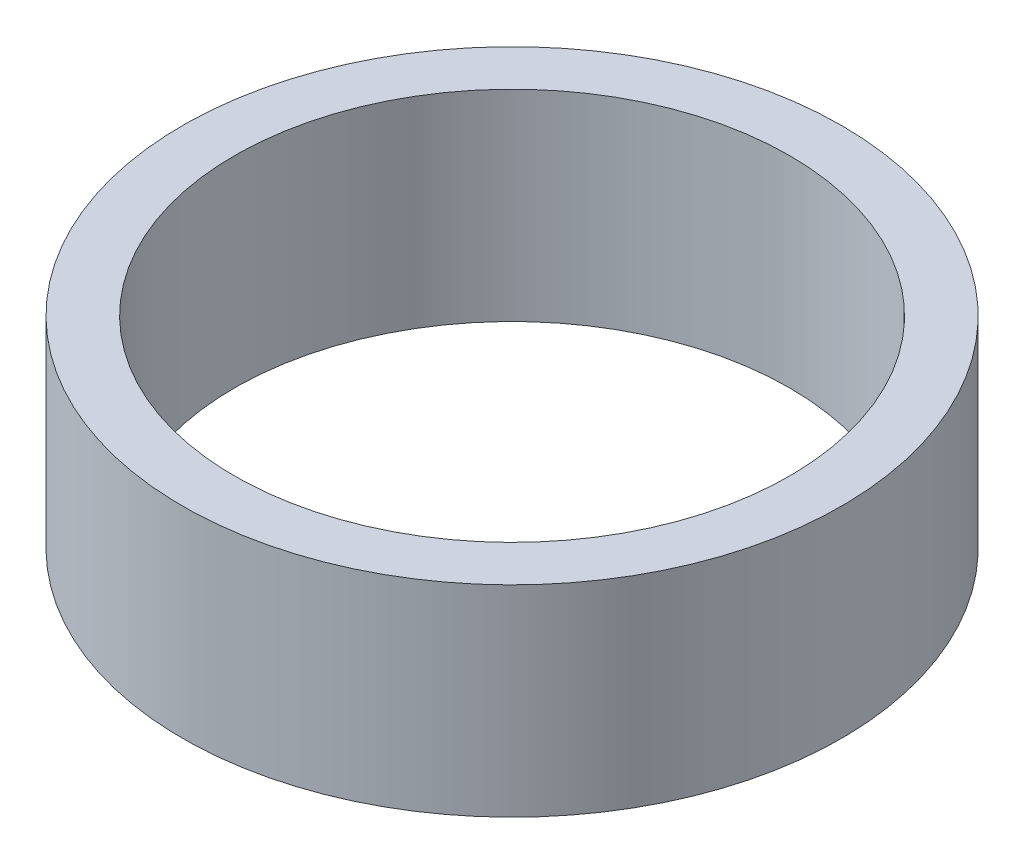
ISO-10303-21;
HEADER;
FILE_DESCRIPTION(('STEP AP214'),'2;1');
FILE_NAME('part.step','',(''),(''),'','','');
FILE_SCHEMA(('AUTOMOTIVE_DESIGN { 1 0 10303 214 1 1 1 1 }'));
ENDSEC;
DATA;
#1=APPLICATION_CONTEXT('core data for automotive mechanical design processes');
#2=APPLICATION_PROTOCOL_DEFINITION('international standard','automotive_design',2000,#1);
#3=PRODUCT_CONTEXT('',#1,'mechanical');
#4=PRODUCT('Part','Part','',(#3));
#5=PRODUCT_RELATED_PRODUCT_CATEGORY('part','',(#4));
#6=PRODUCT_DEFINITION_FORMATION('','',#4);
#7=PRODUCT_DEFINITION_CONTEXT('part definition',#1,'design');
#8=PRODUCT_DEFINITION('design','',#6,#7);
#9=PRODUCT_DEFINITION_SHAPE('','',#8);
#10=(LENGTH_UNIT() NAMED_UNIT(*) SI_UNIT(.MILLI.,.METRE.));
#11=(NAMED_UNIT(*) PLANE_ANGLE_UNIT() SI_UNIT($,.RADIAN.));
#12=(NAMED_UNIT(*) SI_UNIT($,.STERADIAN.) SOLID_ANGLE_UNIT());
#13=UNCERTAINTY_MEASURE_WITH_UNIT(LENGTH_MEASURE(1.E-05),#10,'distance_accuracy_value','');
#14=(GEOMETRIC_REPRESENTATION_CONTEXT(3) GLOBAL_UNCERTAINTY_ASSIGNED_CONTEXT((#13)) GLOBAL_UNIT_ASSIGNED_CONTEXT((#10,
#11,#12)) REPRESENTATION_CONTEXT('',''));
#15=CARTESIAN_POINT('',(0.,0.,0.));
#16=DIRECTION('',(0.,0.,1.));
#17=DIRECTION('',(1.,0.,0.));
#18=AXIS2_PLACEMENT_3D('',#15,#16,#17);
#19=CARTESIAN_POINT('',(0.,29.,0.));
#20=DIRECTION('',(0.,-1.,0.));
#21=DIRECTION('',(0.,0.,-1.));
#22=AXIS2_PLACEMENT_3D('',#19,#20,#21);
#23=CYLINDRICAL_SURFACE('',#22,47.5);
#24=CARTESIAN_POINT('',(0.,29.,0.));
#25=DIRECTION('',(0.,1.,0.));
#26=DIRECTION('',(0.,0.,1.));
#27=AXIS2_PLACEMENT_3D('',#24,#25,#26);
#28=CIRCLE('',#27,47.5);
#29=CARTESIAN_POINT('',(0.,29.,-47.5));
#30=VERTEX_POINT('',#29);
#31=EDGE_CURVE('E10',#30,#30,#28,.T.);
#32=CARTESIAN_POINT('',(0.,0.,0.));
#33=DIRECTION('',(0.,1.,0.));
#34=DIRECTION('',(0.,0.,1.));
#35=AXIS2_PLACEMENT_3D('',#32,#33,#34);
#36=CIRCLE('',#35,47.5);
#37=CARTESIAN_POINT('',(0.,0.,-47.5));
#38=VERTEX_POINT('',#37);
#39=EDGE_CURVE('E37',#38,#38,#36,.T.);
#40=CARTESIAN_POINT('',(0.,29.,-47.5));
#41=CARTESIAN_POINT('',(0.,28.6979166666667,-47.5));
#42=CARTESIAN_POINT('',(0.,28.3958333333333,-47.5));
#43=CARTESIAN_POINT('',(0.,27.7916666666667,-47.5));
#44=CARTESIAN_POINT('',(0.,27.4895833333333,-47.5));
#45=CARTESIAN_POINT('',(0.,26.8854166666667,-47.5));
#46=CARTESIAN_POINT('',(0.,26.5833333333333,-47.5));
#47=CARTESIAN_POINT('',(0.,25.9791666666667,-47.5));
#48=CARTESIAN_POINT('',(0.,25.6770833333333,-47.5));
#49=CARTESIAN_POINT('',(0.,25.0729166666667,-47.5));
#50=CARTESIAN_POINT('',(0.,24.7708333333333,-47.5));
#51=CARTESIAN_POINT('',(0.,24.1666666666667,-47.5));
#52=CARTESIAN_POINT('',(0.,23.8645833333333,-47.5));
#53=CARTESIAN_POINT('',(0.,23.2604166666667,-47.5));
#54=CARTESIAN_POINT('',(0.,22.9583333333333,-47.5));
#55=CARTESIAN_POINT('',(0.,22.3541666666667,-47.5));
#56=CARTESIAN_POINT('',(0.,22.0520833333333,-47.5));
#57=CARTESIAN_POINT('',(0.,21.4479166666667,-47.5));
#58=CARTESIAN_POINT('',(0.,21.1458333333333,-47.5));
#59=CARTESIAN_POINT('',(0.,20.5416666666667,-47.5));
#60=CARTESIAN_POINT('',(0.,20.2395833333333,-47.5));
#61=CARTESIAN_POINT('',(0.,19.6354166666667,-47.5));
#62=CARTESIAN_POINT('',(0.,19.3333333333333,-47.5));
#63=CARTESIAN_POINT('',(0.,18.7291666666667,-47.5));
#64=CARTESIAN_POINT('',(0.,18.4270833333333,-47.5));
#65=CARTESIAN_POINT('',(0.,17.8229166666667,-47.5));
#66=CARTESIAN_POINT('',(0.,17.5208333333333,-47.5));
#67=CARTESIAN_POINT('',(0.,16.9166666666667,-47.5));
#68=CARTESIAN_POINT('',(0.,16.6145833333333,-47.5));
#69=CARTESIAN_POINT('',(0.,16.0104166666667,-47.5));
#70=CARTESIAN_POINT('',(0.,15.7083333333333,-47.5));
#71=CARTESIAN_POINT('',(0.,15.1041666666667,-47.5));
#72=CARTESIAN_POINT('',(0.,14.8020833333333,-47.5));
#73=CARTESIAN_POINT('',(0.,14.1979166666667,-47.5));
#74=CARTESIAN_POINT('',(0.,13.8958333333333,-47.5));
#75=CARTESIAN_POINT('',(0.,13.2916666666667,-47.5));
#76=CARTESIAN_POINT('',(0.,12.9895833333333,-47.5));
#77=CARTESIAN_POINT('',(0.,12.3854166666667,-47.5));
#78=CARTESIAN_POINT('',(0.,12.0833333333333,-47.5));
#79=CARTESIAN_POINT('',(0.,11.4791666666667,-47.5));
#80=CARTESIAN_POINT('',(0.,11.1770833333333,-47.5));
#81=CARTESIAN_POINT('',(0.,10.5729166666667,-47.5));
#82=CARTESIAN_POINT('',(0.,10.2708333333333,-47.5));
#83=CARTESIAN_POINT('',(0.,9.66666666666667,-47.5));
#84=CARTESIAN_POINT('',(0.,9.36458333333333,-47.5));
#85=CARTESIAN_POINT('',(0.,8.76041666666667,-47.5));
#86=CARTESIAN_POINT('',(0.,8.45833333333333,-47.5));
#87=CARTESIAN_POINT('',(0.,7.85416666666667,-47.5));
#88=CARTESIAN_POINT('',(0.,7.55208333333333,-47.5));
#89=CARTESIAN_POINT('',(0.,6.94791666666667,-47.5));
#90=CARTESIAN_POINT('',(0.,6.64583333333333,-47.5));
#91=CARTESIAN_POINT('',(0.,6.04166666666667,-47.5));
#92=CARTESIAN_POINT('',(0.,5.73958333333333,-47.5));
#93=CARTESIAN_POINT('',(0.,5.13541666666667,-47.5));
#94=CARTESIAN_POINT('',(0.,4.83333333333333,-47.5));
#95=CARTESIAN_POINT('',(0.,4.22916666666667,-47.5));
#96=CARTESIAN_POINT('',(0.,3.92708333333333,-47.5));
#97=CARTESIAN_POINT('',(0.,3.32291666666667,-47.5));
#98=CARTESIAN_POINT('',(0.,3.02083333333333,-47.5));
#99=CARTESIAN_POINT('',(0.,2.41666666666667,-47.5));
#100=CARTESIAN_POINT('',(0.,2.11458333333333,-47.5));
#101=CARTESIAN_POINT('',(0.,1.51041666666667,-47.5));
#102=CARTESIAN_POINT('',(0.,1.20833333333333,-47.5));
#103=CARTESIAN_POINT('',(0.,0.604166666666667,-47.5));
#104=CARTESIAN_POINT('',(0.,0.302083333333333,-47.5));
#105=CARTESIAN_POINT('',(0.,0.,-47.5));
#106=B_SPLINE_CURVE_WITH_KNOTS('',3,(#40,#41,#42,#43,#44,#45,#46,#47,#48,#49,#50,#51,#52,#53,
#54,#55,#56,#57,#58,#59,#60,#61,#62,#63,#64,#65,#66,#67,#68,#69,#70,#71,#72,#73,#74,#75,#76,#77,
#78,#79,#80,#81,#82,#83,#84,#85,#86,#87,#88,#89,#90,#91,#92,#93,#94,#95,#96,#97,#98,#99,#100,
#101,#102,#103,#104,#105),.UNSPECIFIED.,.F.,.F.,(4,2,2,2,2,2,2,2,2,2,2,2,2,2,2,2,2,2,2,2,2,2,2,
2,2,2,2,2,2,2,2,2,4),(0.,0.906249999999997,1.8125,2.71875,3.625,4.53125,5.4375,6.34375,7.25,
8.15625,9.0625,9.96875,10.875,11.78125,12.6875,13.59375,14.5,15.40625,16.3125,17.21875,18.125,
19.03125,19.9375,20.84375,21.75,22.65625,23.5625,24.46875,25.375,26.28125,27.1875,28.09375,29.),.UNSPECIFIED.);
#107=EDGE_CURVE('BSEAM40',#30,#38,#106,.T.);
#108=ORIENTED_EDGE('',*,*,#31,.F.);
#109=ORIENTED_EDGE('',*,*,#39,.T.);
#110=ORIENTED_EDGE('',*,*,#107,.T.);
#111=ORIENTED_EDGE('',*,*,#107,.F.);
#112=EDGE_LOOP('',(#108,#110,#109,#111));
#113=FACE_BOUND('',#112,.T.);
#114=ADVANCED_FACE('F40',(#113),#23,.T.);
#115=CARTESIAN_POINT('',(0.,29.,0.));
#116=DIRECTION('',(0.,1.,0.));
#117=DIRECTION('',(0.,0.,1.));
#118=AXIS2_PLACEMENT_3D('',#115,#116,#117);
#119=PLANE('',#118);
#120=CARTESIAN_POINT('',(0.,29.,0.));
#121=DIRECTION('',(0.,1.,0.));
#122=DIRECTION('',(0.,0.,1.));
#123=AXIS2_PLACEMENT_3D('',#120,#121,#122);
#124=CIRCLE('',#123,40.);
#125=CARTESIAN_POINT('',(0.,29.,-40.));
#126=VERTEX_POINT('',#125);
#127=EDGE_CURVE('E50',#126,#126,#124,.T.);
#128=ORIENTED_EDGE('',*,*,#127,.F.);
#129=EDGE_LOOP('',(#128));
#130=FACE_BOUND('',#129,.T.);
#131=ORIENTED_EDGE('',*,*,#31,.T.);
#132=EDGE_LOOP('',(#131));
#133=FACE_BOUND('',#132,.T.);
#134=ADVANCED_FACE('F59',(#130,#133),#119,.T.);
#135=CARTESIAN_POINT('',(0.,0.,0.));
#136=DIRECTION('',(0.,1.,0.));
#137=DIRECTION('',(0.,0.,1.));
#138=AXIS2_PLACEMENT_3D('',#135,#136,#137);
#139=PLANE('',#138);
#140=CARTESIAN_POINT('',(0.,0.,0.));
#141=DIRECTION('',(0.,1.,0.));
#142=DIRECTION('',(0.,0.,1.));
#143=AXIS2_PLACEMENT_3D('',#140,#141,#142);
#144=CIRCLE('',#143,40.);
#145=CARTESIAN_POINT('',(0.,0.,-40.));
#146=VERTEX_POINT('',#145);
#147=EDGE_CURVE('E47',#146,#146,#144,.T.);
#148=ORIENTED_EDGE('',*,*,#147,.T.);
#149=EDGE_LOOP('',(#148));
#150=FACE_BOUND('',#149,.T.);
#151=ORIENTED_EDGE('',*,*,#39,.F.);
#152=EDGE_LOOP('',(#151));
#153=FACE_BOUND('',#152,.T.);
#154=ADVANCED_FACE('F58',(#150,#153),#139,.F.);
#155=CARTESIAN_POINT('',(0.,29.,0.));
#156=DIRECTION('',(0.,-1.,0.));
#157=DIRECTION('',(0.,0.,-1.));
#158=AXIS2_PLACEMENT_3D('',#155,#156,#157);
#159=CYLINDRICAL_SURFACE('',#158,40.);
#160=CARTESIAN_POINT('',(0.,29.,-40.));
#161=CARTESIAN_POINT('',(0.,28.6979166666667,-40.));
#162=CARTESIAN_POINT('',(0.,28.3958333333333,-40.));
#163=CARTESIAN_POINT('',(0.,27.7916666666667,-40.));
#164=CARTESIAN_POINT('',(0.,27.4895833333333,-40.));
#165=CARTESIAN_POINT('',(0.,26.8854166666667,-40.));
#166=CARTESIAN_POINT('',(0.,26.5833333333333,-40.));
#167=CARTESIAN_POINT('',(0.,25.9791666666667,-40.));
#168=CARTESIAN_POINT('',(0.,25.6770833333333,-40.));
#169=CARTESIAN_POINT('',(0.,25.0729166666667,-40.));
#170=CARTESIAN_POINT('',(0.,24.7708333333333,-40.));
#171=CARTESIAN_POINT('',(0.,24.1666666666667,-40.));
#172=CARTESIAN_POINT('',(0.,23.8645833333333,-40.));
#173=CARTESIAN_POINT('',(0.,23.2604166666667,-40.));
#174=CARTESIAN_POINT('',(0.,22.9583333333333,-40.));
#175=CARTESIAN_POINT('',(0.,22.3541666666667,-40.));
#176=CARTESIAN_POINT('',(0.,22.0520833333333,-40.));
#177=CARTESIAN_POINT('',(0.,21.4479166666667,-40.));
#178=CARTESIAN_POINT('',(0.,21.1458333333333,-40.));
#179=CARTESIAN_POINT('',(0.,20.5416666666667,-40.));
#180=CARTESIAN_POINT('',(0.,20.2395833333333,-40.));
#181=CARTESIAN_POINT('',(0.,19.6354166666667,-40.));
#182=CARTESIAN_POINT('',(0.,19.3333333333333,-40.));
#183=CARTESIAN_POINT('',(0.,18.7291666666667,-40.));
#184=CARTESIAN_POINT('',(0.,18.4270833333333,-40.));
#185=CARTESIAN_POINT('',(0.,17.8229166666667,-40.));
#186=CARTESIAN_POINT('',(0.,17.5208333333333,-40.));
#187=CARTESIAN_POINT('',(0.,16.9166666666667,-40.));
#188=CARTESIAN_POINT('',(0.,16.6145833333333,-40.));
#189=CARTESIAN_POINT('',(0.,16.0104166666667,-40.));
#190=CARTESIAN_POINT('',(0.,15.7083333333333,-40.));
#191=CARTESIAN_POINT('',(0.,15.1041666666667,-40.));
#192=CARTESIAN_POINT('',(0.,14.8020833333333,-40.));
#193=CARTESIAN_POINT('',(0.,14.1979166666667,-40.));
#194=CARTESIAN_POINT('',(0.,13.8958333333333,-40.));
#195=CARTESIAN_POINT('',(0.,13.2916666666667,-40.));
#196=CARTESIAN_POINT('',(0.,12.9895833333333,-40.));
#197=CARTESIAN_POINT('',(0.,12.3854166666667,-40.));
#198=CARTESIAN_POINT('',(0.,12.0833333333333,-40.));
#199=CARTESIAN_POINT('',(0.,11.4791666666667,-40.));
#200=CARTESIAN_POINT('',(0.,11.1770833333333,-40.));
#201=CARTESIAN_POINT('',(0.,10.5729166666667,-40.));
#202=CARTESIAN_POINT('',(0.,10.2708333333333,-40.));
#203=CARTESIAN_POINT('',(0.,9.66666666666667,-40.));
#204=CARTESIAN_POINT('',(0.,9.36458333333333,-40.));
#205=CARTESIAN_POINT('',(0.,8.76041666666667,-40.));
#206=CARTESIAN_POINT('',(0.,8.45833333333333,-40.));
#207=CARTESIAN_POINT('',(0.,7.85416666666667,-40.));
#208=CARTESIAN_POINT('',(0.,7.55208333333333,-40.));
#209=CARTESIAN_POINT('',(0.,6.94791666666667,-40.));
#210=CARTESIAN_POINT('',(0.,6.64583333333333,-40.));
#211=CARTESIAN_POINT('',(0.,6.04166666666667,-40.));
#212=CARTESIAN_POINT('',(0.,5.73958333333333,-40.));
#213=CARTESIAN_POINT('',(0.,5.13541666666667,-40.));
#214=CARTESIAN_POINT('',(0.,4.83333333333333,-40.));
#215=CARTESIAN_POINT('',(0.,4.22916666666667,-40.));
#216=CARTESIAN_POINT('',(0.,3.92708333333333,-40.));
#217=CARTESIAN_POINT('',(0.,3.32291666666667,-40.));
#218=CARTESIAN_POINT('',(0.,3.02083333333333,-40.));
#219=CARTESIAN_POINT('',(0.,2.41666666666667,-40.));
#220=CARTESIAN_POINT('',(0.,2.11458333333333,-40.));
#221=CARTESIAN_POINT('',(0.,1.51041666666667,-40.));
#222=CARTESIAN_POINT('',(0.,1.20833333333333,-40.));
#223=CARTESIAN_POINT('',(0.,0.604166666666667,-40.));
#224=CARTESIAN_POINT('',(0.,0.302083333333333,-40.));
#225=CARTESIAN_POINT('',(0.,0.,-40.));
#226=B_SPLINE_CURVE_WITH_KNOTS('',3,(#160,#161,#162,#163,#164,#165,#166,#167,#168,#169,#170,
#171,#172,#173,#174,#175,#176,#177,#178,#179,#180,#181,#182,#183,#184,#185,#186,#187,#188,#189,
#190,#191,#192,#193,#194,#195,#196,#197,#198,#199,#200,#201,#202,#203,#204,#205,#206,#207,#208,
#209,#210,#211,#212,#213,#214,#215,#216,#217,#218,#219,#220,#221,#222,#223,#224,#225),
.UNSPECIFIED.,.F.,.F.,(4,2,2,2,2,2,2,2,2,2,2,2,2,2,2,2,2,2,2,2,2,2,2,2,2,2,2,2,2,2,2,2,4),(0.,
0.906249999999997,1.8125,2.71875,3.625,4.53125,5.4375,6.34375,7.25,8.15625,9.0625,9.96875,
10.875,11.78125,12.6875,13.59375,14.5,15.40625,16.3125,17.21875,18.125,19.03125,19.9375,
20.84375,21.75,22.65625,23.5625,24.46875,25.375,26.28125,27.1875,28.09375,29.),.UNSPECIFIED.);
#227=EDGE_CURVE('BSEAM54',#126,#146,#226,.T.);
#228=ORIENTED_EDGE('',*,*,#127,.T.);
#229=ORIENTED_EDGE('',*,*,#147,.F.);
#230=ORIENTED_EDGE('',*,*,#227,.T.);
#231=ORIENTED_EDGE('',*,*,#227,.F.);
#232=EDGE_LOOP('',(#228,#230,#229,#231));
#233=FACE_BOUND('',#232,.T.);
#234=ADVANCED_FACE('F54',(#233),#159,.F.);
#235=CLOSED_SHELL('',(#114,#134,#154,#234));
#236=MANIFOLD_SOLID_BREP('B2',#235);
#237=ADVANCED_BREP_SHAPE_REPRESENTATION('',(#18,#236),#14);
#238=SHAPE_DEFINITION_REPRESENTATION(#9,#237);
ENDSEC;
END-ISO-10303-21;
